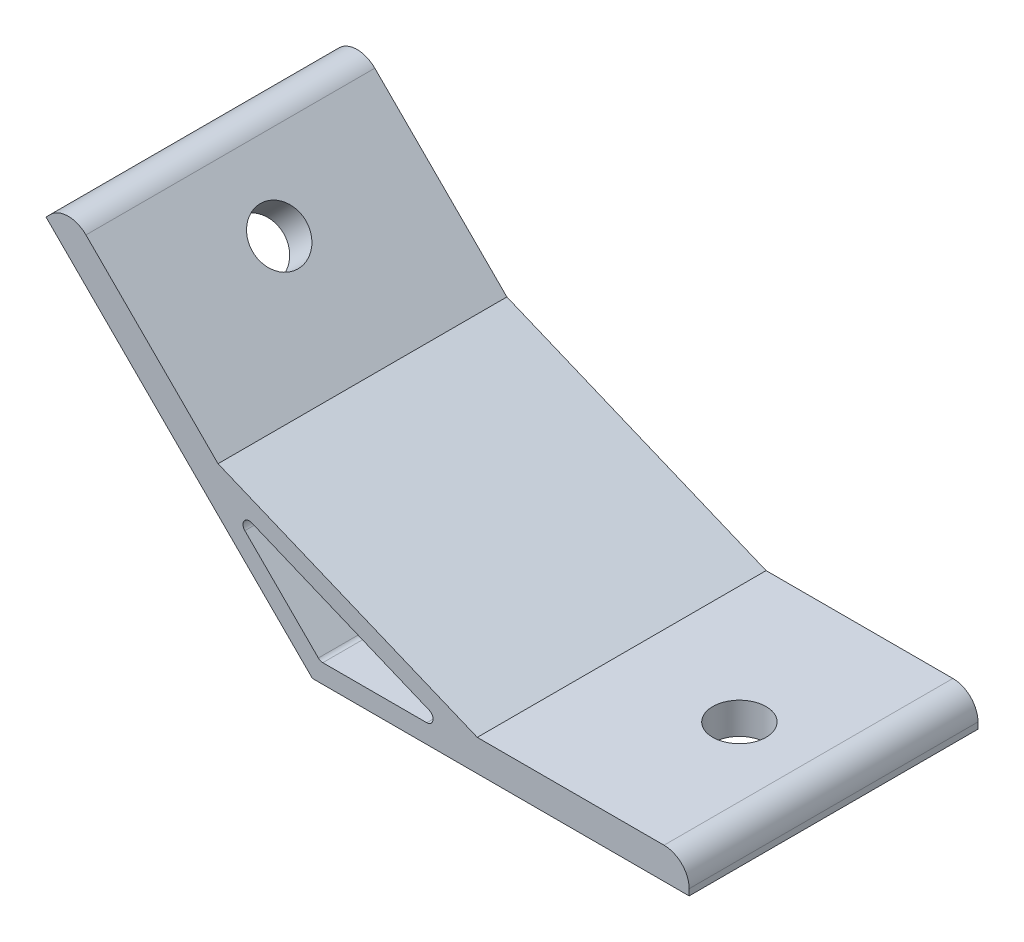
ISO-10303-21;
HEADER;
FILE_DESCRIPTION(('STEP AP214'),'2;1');
FILE_NAME('part.step','',(''),(''),'','','');
FILE_SCHEMA(('AUTOMOTIVE_DESIGN { 1 0 10303 214 1 1 1 1 }'));
ENDSEC;
DATA;
#1=APPLICATION_CONTEXT('core data for automotive mechanical design processes');
#2=APPLICATION_PROTOCOL_DEFINITION('international standard','automotive_design',2000,#1);
#3=PRODUCT_CONTEXT('',#1,'mechanical');
#4=PRODUCT('Part','Part','',(#3));
#5=PRODUCT_RELATED_PRODUCT_CATEGORY('part','',(#4));
#6=PRODUCT_DEFINITION_FORMATION('','',#4);
#7=PRODUCT_DEFINITION_CONTEXT('part definition',#1,'design');
#8=PRODUCT_DEFINITION('design','',#6,#7);
#9=PRODUCT_DEFINITION_SHAPE('','',#8);
#10=(LENGTH_UNIT() NAMED_UNIT(*) SI_UNIT(.MILLI.,.METRE.));
#11=(NAMED_UNIT(*) PLANE_ANGLE_UNIT() SI_UNIT($,.RADIAN.));
#12=(NAMED_UNIT(*) SI_UNIT($,.STERADIAN.) SOLID_ANGLE_UNIT());
#13=UNCERTAINTY_MEASURE_WITH_UNIT(LENGTH_MEASURE(1.E-05),#10,'distance_accuracy_value','');
#14=(GEOMETRIC_REPRESENTATION_CONTEXT(3) GLOBAL_UNCERTAINTY_ASSIGNED_CONTEXT((#13)) GLOBAL_UNIT_ASSIGNED_CONTEXT((#10,
#11,#12)) REPRESENTATION_CONTEXT('',''));
#15=CARTESIAN_POINT('',(0.,0.,0.));
#16=DIRECTION('',(0.,0.,1.));
#17=DIRECTION('',(1.,0.,0.));
#18=AXIS2_PLACEMENT_3D('',#15,#16,#17);
#19=CARTESIAN_POINT('',(0.,0.,23.));
#20=DIRECTION('',(0.,0.,1.));
#21=DIRECTION('',(1.,0.,0.));
#22=AXIS2_PLACEMENT_3D('',#19,#20,#21);
#23=PLANE('',#22);
#24=DIRECTION('',(0.,1.,0.));
#25=VECTOR('',#24,1.);
#26=CARTESIAN_POINT('',(60.,5.,23.));
#27=LINE('',#26,#25);
#28=CARTESIAN_POINT('',(60.,0.,23.));
#29=VERTEX_POINT('',#28);
#30=CARTESIAN_POINT('',(60.,1.,23.));
#31=VERTEX_POINT('',#30);
#32=EDGE_CURVE('E142',#29,#31,#27,.T.);
#33=ORIENTED_EDGE('',*,*,#32,.T.);
#34=CARTESIAN_POINT('',(56.,1.,23.));
#35=DIRECTION('',(0.,0.,1.));
#36=DIRECTION('',(1.,0.,0.));
#37=AXIS2_PLACEMENT_3D('',#34,#35,#36);
#38=CIRCLE('',#37,4.);
#39=CARTESIAN_POINT('',(56.,5.,23.));
#40=VERTEX_POINT('',#39);
#41=EDGE_CURVE('E184',#31,#40,#38,.T.);
#42=ORIENTED_EDGE('',*,*,#41,.T.);
#43=DIRECTION('',(-1.,0.,0.));
#44=VECTOR('',#43,1.);
#45=CARTESIAN_POINT('',(26.2535913516314,5.,23.));
#46=LINE('',#45,#44);
#47=CARTESIAN_POINT('',(26.2535913516314,5.,23.));
#48=VERTEX_POINT('',#47);
#49=EDGE_CURVE('E153',#40,#48,#46,.T.);
#50=ORIENTED_EDGE('',*,*,#49,.T.);
#51=DIRECTION('',(-0.923879532511286,0.382683432365091,0.));
#52=VECTOR('',#51,1.);
#53=CARTESIAN_POINT('',(-15.0285585693062,22.0996263811718,23.));
#54=LINE('',#53,#52);
#55=CARTESIAN_POINT('',(-15.0285585693062,22.0996263811718,23.));
#56=VERTEX_POINT('',#55);
#57=EDGE_CURVE('E244',#48,#56,#54,.T.);
#58=ORIENTED_EDGE('',*,*,#57,.T.);
#59=DIRECTION('',(-0.707106781186546,0.707106781186549,0.));
#60=VECTOR('',#59,1.);
#61=CARTESIAN_POINT('',(-38.89087296526,45.9619407771256,23.));
#62=LINE('',#61,#60);
#63=CARTESIAN_POINT('',(-36.0624458405138,43.1335136523795,23.));
#64=VERTEX_POINT('',#63);
#65=EDGE_CURVE('E246',#56,#64,#62,.T.);
#66=ORIENTED_EDGE('',*,*,#65,.T.);
#67=CARTESIAN_POINT('',(-38.89087296526,40.3050865276333,23.));
#68=DIRECTION('',(0.,0.,1.));
#69=DIRECTION('',(1.,0.,0.));
#70=AXIS2_PLACEMENT_3D('',#67,#68,#69);
#71=CIRCLE('',#70,4.);
#72=CARTESIAN_POINT('',(-41.7193000900062,43.1335136523795,23.));
#73=VERTEX_POINT('',#72);
#74=EDGE_CURVE('E182',#64,#73,#71,.T.);
#75=ORIENTED_EDGE('',*,*,#74,.T.);
#76=DIRECTION('',(-0.707106781186549,-0.707106781186546,0.));
#77=VECTOR('',#76,1.);
#78=CARTESIAN_POINT('',(-42.4264068711928,42.4264068711929,23.));
#79=LINE('',#78,#77);
#80=CARTESIAN_POINT('',(-42.4264068711928,42.4264068711929,23.));
#81=VERTEX_POINT('',#80);
#82=EDGE_CURVE('E249',#73,#81,#79,.T.);
#83=ORIENTED_EDGE('',*,*,#82,.T.);
#84=DIRECTION('',(0.707106781186546,-0.707106781186549,0.));
#85=VECTOR('',#84,1.);
#86=CARTESIAN_POINT('',(0.,0.,23.));
#87=LINE('',#86,#85);
#88=CARTESIAN_POINT('',(0.,0.,23.));
#89=VERTEX_POINT('',#88);
#90=EDGE_CURVE('E158',#81,#89,#87,.T.);
#91=ORIENTED_EDGE('',*,*,#90,.T.);
#92=DIRECTION('',(1.,0.,0.));
#93=VECTOR('',#92,1.);
#94=CARTESIAN_POINT('',(60.,0.,23.));
#95=LINE('',#94,#93);
#96=EDGE_CURVE('E154',#89,#29,#95,.T.);
#97=ORIENTED_EDGE('',*,*,#96,.T.);
#98=EDGE_LOOP('',(#33,#42,#50,#58,#66,#75,#83,#91,#97));
#99=FACE_BOUND('',#98,.T.);
#100=DIRECTION('',(1.,0.,0.));
#101=VECTOR('',#100,1.);
#102=CARTESIAN_POINT('',(23.2426406871193,3.,23.));
#103=LINE('',#102,#101);
#104=CARTESIAN_POINT('',(1.65685424949238,3.,23.));
#105=VERTEX_POINT('',#104);
#106=CARTESIAN_POINT('',(18.2153011949935,3.,23.));
#107=VERTEX_POINT('',#106);
#108=EDGE_CURVE('E229',#105,#107,#103,.T.);
#109=ORIENTED_EDGE('',*,*,#108,.F.);
#110=CARTESIAN_POINT('',(1.65685424949239,4.,23.));
#111=DIRECTION('',(0.,0.,1.));
#112=DIRECTION('',(1.,0.,0.));
#113=AXIS2_PLACEMENT_3D('',#110,#111,#112);
#114=CIRCLE('',#113,1.);
#115=CARTESIAN_POINT('',(0.949747468305837,3.29289321881345,23.));
#116=VERTEX_POINT('',#115);
#117=EDGE_CURVE('E211',#105,#116,#114,.F.);
#118=ORIENTED_EDGE('',*,*,#117,.T.);
#119=DIRECTION('',(0.707106781186546,-0.707106781186549,0.));
#120=VECTOR('',#119,1.);
#121=CARTESIAN_POINT('',(1.24264068711929,3.,23.));
#122=LINE('',#121,#120);
#123=CARTESIAN_POINT('',(-10.7588426527756,15.001483339895,23.));
#124=VERTEX_POINT('',#123);
#125=EDGE_CURVE('E226',#124,#116,#122,.T.);
#126=ORIENTED_EDGE('',*,*,#125,.F.);
#127=CARTESIAN_POINT('',(-10.0517358715891,15.7085901210815,23.));
#128=DIRECTION('',(0.,0.,1.));
#129=DIRECTION('',(1.,0.,0.));
#130=AXIS2_PLACEMENT_3D('',#127,#128,#129);
#131=CIRCLE('',#130,1.);
#132=CARTESIAN_POINT('',(-9.66905243922398,16.6324696535928,23.));
#133=VERTEX_POINT('',#132);
#134=EDGE_CURVE('E207',#124,#133,#131,.F.);
#135=ORIENTED_EDGE('',*,*,#134,.T.);
#136=DIRECTION('',(-0.923879532511286,0.382683432365091,0.));
#137=VECTOR('',#136,1.);
#138=CARTESIAN_POINT('',(-14.3137084989847,18.5563491861041,23.));
#139=LINE('',#138,#137);
#140=CARTESIAN_POINT('',(18.5979846273585,4.92387953251129,23.));
#141=VERTEX_POINT('',#140);
#142=EDGE_CURVE('E231',#141,#133,#139,.T.);
#143=ORIENTED_EDGE('',*,*,#142,.F.);
#144=CARTESIAN_POINT('',(18.2153011949935,4.,23.));
#145=DIRECTION('',(0.,0.,1.));
#146=DIRECTION('',(1.,0.,0.));
#147=AXIS2_PLACEMENT_3D('',#144,#145,#146);
#148=CIRCLE('',#147,1.);
#149=EDGE_CURVE('E11',#141,#107,#148,.F.);
#150=ORIENTED_EDGE('',*,*,#149,.T.);
#151=EDGE_LOOP('',(#109,#118,#126,#135,#143,#150));
#152=FACE_BOUND('',#151,.T.);
#153=ADVANCED_FACE('F35',(#99,#152),#23,.T.);
#154=CARTESIAN_POINT('',(0.,0.,-23.));
#155=DIRECTION('',(0.,0.,1.));
#156=DIRECTION('',(1.,0.,0.));
#157=AXIS2_PLACEMENT_3D('',#154,#155,#156);
#158=PLANE('',#157);
#159=DIRECTION('',(-1.,0.,0.));
#160=VECTOR('',#159,1.);
#161=CARTESIAN_POINT('',(26.2535913516314,5.,-23.));
#162=LINE('',#161,#160);
#163=CARTESIAN_POINT('',(56.,5.,-23.));
#164=VERTEX_POINT('',#163);
#165=CARTESIAN_POINT('',(26.2535913516314,5.,-23.));
#166=VERTEX_POINT('',#165);
#167=EDGE_CURVE('E256',#164,#166,#162,.T.);
#168=ORIENTED_EDGE('',*,*,#167,.F.);
#169=CARTESIAN_POINT('',(56.,1.,-23.));
#170=DIRECTION('',(0.,0.,1.));
#171=DIRECTION('',(1.,0.,0.));
#172=AXIS2_PLACEMENT_3D('',#169,#170,#171);
#173=CIRCLE('',#172,4.);
#174=CARTESIAN_POINT('',(60.,1.,-23.));
#175=VERTEX_POINT('',#174);
#176=EDGE_CURVE('E179',#164,#175,#173,.F.);
#177=ORIENTED_EDGE('',*,*,#176,.T.);
#178=DIRECTION('',(0.,1.,0.));
#179=VECTOR('',#178,1.);
#180=CARTESIAN_POINT('',(60.,5.,-23.));
#181=LINE('',#180,#179);
#182=CARTESIAN_POINT('',(60.,0.,-23.));
#183=VERTEX_POINT('',#182);
#184=EDGE_CURVE('E254',#183,#175,#181,.T.);
#185=ORIENTED_EDGE('',*,*,#184,.F.);
#186=DIRECTION('',(1.,0.,0.));
#187=VECTOR('',#186,1.);
#188=CARTESIAN_POINT('',(60.,0.,-23.));
#189=LINE('',#188,#187);
#190=CARTESIAN_POINT('',(0.,0.,-23.));
#191=VERTEX_POINT('',#190);
#192=EDGE_CURVE('E166',#191,#183,#189,.T.);
#193=ORIENTED_EDGE('',*,*,#192,.F.);
#194=DIRECTION('',(0.707106781186546,-0.707106781186549,0.));
#195=VECTOR('',#194,1.);
#196=CARTESIAN_POINT('',(0.,0.,-23.));
#197=LINE('',#196,#195);
#198=CARTESIAN_POINT('',(-42.4264068711928,42.4264068711929,-23.));
#199=VERTEX_POINT('',#198);
#200=EDGE_CURVE('E162',#199,#191,#197,.T.);
#201=ORIENTED_EDGE('',*,*,#200,.F.);
#202=DIRECTION('',(-0.707106781186549,-0.707106781186546,0.));
#203=VECTOR('',#202,1.);
#204=CARTESIAN_POINT('',(-42.4264068711928,42.4264068711929,-23.));
#205=LINE('',#204,#203);
#206=CARTESIAN_POINT('',(-41.7193000900062,43.1335136523795,-23.));
#207=VERTEX_POINT('',#206);
#208=EDGE_CURVE('E263',#207,#199,#205,.T.);
#209=ORIENTED_EDGE('',*,*,#208,.F.);
#210=CARTESIAN_POINT('',(-38.89087296526,40.3050865276333,-23.));
#211=DIRECTION('',(0.,0.,1.));
#212=DIRECTION('',(1.,0.,0.));
#213=AXIS2_PLACEMENT_3D('',#210,#211,#212);
#214=CIRCLE('',#213,4.);
#215=CARTESIAN_POINT('',(-36.0624458405138,43.1335136523795,-23.));
#216=VERTEX_POINT('',#215);
#217=EDGE_CURVE('E171',#207,#216,#214,.F.);
#218=ORIENTED_EDGE('',*,*,#217,.T.);
#219=DIRECTION('',(-0.707106781186546,0.707106781186549,0.));
#220=VECTOR('',#219,1.);
#221=CARTESIAN_POINT('',(-38.89087296526,45.9619407771256,-23.));
#222=LINE('',#221,#220);
#223=CARTESIAN_POINT('',(-15.0285585693062,22.0996263811718,-23.));
#224=VERTEX_POINT('',#223);
#225=EDGE_CURVE('E260',#224,#216,#222,.T.);
#226=ORIENTED_EDGE('',*,*,#225,.F.);
#227=DIRECTION('',(-0.923879532511286,0.382683432365091,0.));
#228=VECTOR('',#227,1.);
#229=CARTESIAN_POINT('',(-15.0285585693062,22.0996263811718,-23.));
#230=LINE('',#229,#228);
#231=EDGE_CURVE('E258',#166,#224,#230,.T.);
#232=ORIENTED_EDGE('',*,*,#231,.F.);
#233=EDGE_LOOP('',(#168,#177,#185,#193,#201,#209,#218,#226,#232));
#234=FACE_BOUND('',#233,.T.);
#235=DIRECTION('',(-0.923879532511286,0.382683432365091,0.));
#236=VECTOR('',#235,1.);
#237=CARTESIAN_POINT('',(-14.3137084989847,18.5563491861041,-23.));
#238=LINE('',#237,#236);
#239=CARTESIAN_POINT('',(18.5979846273585,4.92387953251129,-23.));
#240=VERTEX_POINT('',#239);
#241=CARTESIAN_POINT('',(-9.66905243922398,16.6324696535928,-23.));
#242=VERTEX_POINT('',#241);
#243=EDGE_CURVE('E217',#240,#242,#238,.T.);
#244=ORIENTED_EDGE('',*,*,#243,.T.);
#245=CARTESIAN_POINT('',(-10.0517358715891,15.7085901210815,-23.));
#246=DIRECTION('',(0.,0.,1.));
#247=DIRECTION('',(1.,0.,0.));
#248=AXIS2_PLACEMENT_3D('',#245,#246,#247);
#249=CIRCLE('',#248,1.);
#250=CARTESIAN_POINT('',(-10.7588426527756,15.001483339895,-23.));
#251=VERTEX_POINT('',#250);
#252=EDGE_CURVE('E205',#242,#251,#249,.T.);
#253=ORIENTED_EDGE('',*,*,#252,.T.);
#254=DIRECTION('',(0.707106781186546,-0.707106781186549,0.));
#255=VECTOR('',#254,1.);
#256=CARTESIAN_POINT('',(1.24264068711929,3.,-23.));
#257=LINE('',#256,#255);
#258=CARTESIAN_POINT('',(0.949747468305837,3.29289321881345,-23.));
#259=VERTEX_POINT('',#258);
#260=EDGE_CURVE('E238',#251,#259,#257,.T.);
#261=ORIENTED_EDGE('',*,*,#260,.T.);
#262=CARTESIAN_POINT('',(1.65685424949239,4.,-23.));
#263=DIRECTION('',(0.,0.,1.));
#264=DIRECTION('',(1.,0.,0.));
#265=AXIS2_PLACEMENT_3D('',#262,#263,#264);
#266=CIRCLE('',#265,1.);
#267=CARTESIAN_POINT('',(1.65685424949238,3.,-23.));
#268=VERTEX_POINT('',#267);
#269=EDGE_CURVE('E209',#259,#268,#266,.T.);
#270=ORIENTED_EDGE('',*,*,#269,.T.);
#271=DIRECTION('',(1.,0.,0.));
#272=VECTOR('',#271,1.);
#273=CARTESIAN_POINT('',(23.2426406871193,3.,-23.));
#274=LINE('',#273,#272);
#275=CARTESIAN_POINT('',(18.2153011949935,3.,-23.));
#276=VERTEX_POINT('',#275);
#277=EDGE_CURVE('E218',#268,#276,#274,.T.);
#278=ORIENTED_EDGE('',*,*,#277,.T.);
#279=CARTESIAN_POINT('',(18.2153011949935,4.,-23.));
#280=DIRECTION('',(0.,0.,1.));
#281=DIRECTION('',(1.,0.,0.));
#282=AXIS2_PLACEMENT_3D('',#279,#280,#281);
#283=CIRCLE('',#282,1.);
#284=EDGE_CURVE('E43',#276,#240,#283,.T.);
#285=ORIENTED_EDGE('',*,*,#284,.T.);
#286=EDGE_LOOP('',(#244,#253,#261,#270,#278,#285));
#287=FACE_BOUND('',#286,.T.);
#288=ADVANCED_FACE('F216',(#234,#287),#158,.F.);
#289=CARTESIAN_POINT('',(60.,0.,23.));
#290=DIRECTION('',(0.,1.,0.));
#291=DIRECTION('',(0.,0.,1.));
#292=AXIS2_PLACEMENT_3D('',#289,#290,#291);
#293=PLANE('',#292);
#294=CARTESIAN_POINT('',(45.,0.,0.));
#295=DIRECTION('',(0.,-1.,0.));
#296=DIRECTION('',(0.,0.,-1.));
#297=AXIS2_PLACEMENT_3D('',#294,#295,#296);
#298=CIRCLE('',#297,4.25000000000001);
#299=CARTESIAN_POINT('',(45.,0.,-4.25000000000001));
#300=VERTEX_POINT('',#299);
#301=EDGE_CURVE('E343',#300,#300,#298,.T.);
#302=ORIENTED_EDGE('',*,*,#301,.F.);
#303=EDGE_LOOP('',(#302));
#304=FACE_BOUND('',#303,.T.);
#305=ORIENTED_EDGE('',*,*,#192,.T.);
#306=DIRECTION('',(0.,0.,-1.));
#307=VECTOR('',#306,1.);
#308=CARTESIAN_POINT('',(60.,0.,23.));
#309=LINE('',#308,#307);
#310=EDGE_CURVE('E147',#29,#183,#309,.T.);
#311=ORIENTED_EDGE('',*,*,#310,.F.);
#312=ORIENTED_EDGE('',*,*,#96,.F.);
#313=DIRECTION('',(0.,0.,-1.));
#314=VECTOR('',#313,1.);
#315=CARTESIAN_POINT('',(0.,0.,23.));
#316=LINE('',#315,#314);
#317=EDGE_CURVE('E252',#89,#191,#316,.T.);
#318=ORIENTED_EDGE('',*,*,#317,.T.);
#319=EDGE_LOOP('',(#305,#311,#312,#318));
#320=FACE_BOUND('',#319,.T.);
#321=ADVANCED_FACE('F164',(#304,#320),#293,.F.);
#322=CARTESIAN_POINT('',(60.,5.,23.));
#323=DIRECTION('',(-1.,0.,0.));
#324=DIRECTION('',(0.,0.,1.));
#325=AXIS2_PLACEMENT_3D('',#322,#323,#324);
#326=PLANE('',#325);
#327=ORIENTED_EDGE('',*,*,#184,.T.);
#328=DIRECTION('',(0.,0.,-1.));
#329=VECTOR('',#328,1.);
#330=CARTESIAN_POINT('',(60.,1.,23.));
#331=LINE('',#330,#329);
#332=EDGE_CURVE('E150',#175,#31,#331,.F.);
#333=ORIENTED_EDGE('',*,*,#332,.T.);
#334=ORIENTED_EDGE('',*,*,#32,.F.);
#335=ORIENTED_EDGE('',*,*,#310,.T.);
#336=EDGE_LOOP('',(#327,#333,#334,#335));
#337=FACE_BOUND('',#336,.T.);
#338=ADVANCED_FACE('F145',(#337),#326,.F.);
#339=CARTESIAN_POINT('',(26.2535913516314,5.,23.));
#340=DIRECTION('',(0.,-1.,0.));
#341=DIRECTION('',(0.,0.,-1.));
#342=AXIS2_PLACEMENT_3D('',#339,#340,#341);
#343=PLANE('',#342);
#344=CARTESIAN_POINT('',(45.,5.,0.));
#345=DIRECTION('',(0.,-1.,0.));
#346=DIRECTION('',(0.,0.,-1.));
#347=AXIS2_PLACEMENT_3D('',#344,#345,#346);
#348=CIRCLE('',#347,4.25000000000001);
#349=CARTESIAN_POINT('',(45.,5.,-4.25000000000001));
#350=VERTEX_POINT('',#349);
#351=EDGE_CURVE('E345',#350,#350,#348,.F.);
#352=ORIENTED_EDGE('',*,*,#351,.F.);
#353=EDGE_LOOP('',(#352));
#354=FACE_BOUND('',#353,.T.);
#355=ORIENTED_EDGE('',*,*,#49,.F.);
#356=DIRECTION('',(0.,0.,-1.));
#357=VECTOR('',#356,1.);
#358=CARTESIAN_POINT('',(56.,5.,23.));
#359=LINE('',#358,#357);
#360=EDGE_CURVE('E167',#40,#164,#359,.T.);
#361=ORIENTED_EDGE('',*,*,#360,.T.);
#362=ORIENTED_EDGE('',*,*,#167,.T.);
#363=DIRECTION('',(0.,0.,-1.));
#364=VECTOR('',#363,1.);
#365=CARTESIAN_POINT('',(26.2535913516314,5.,23.));
#366=LINE('',#365,#364);
#367=EDGE_CURVE('E168',#48,#166,#366,.T.);
#368=ORIENTED_EDGE('',*,*,#367,.F.);
#369=EDGE_LOOP('',(#355,#361,#362,#368));
#370=FACE_BOUND('',#369,.T.);
#371=ADVANCED_FACE('F295',(#354,#370),#343,.F.);
#372=CARTESIAN_POINT('',(-15.0285585693062,22.0996263811718,23.));
#373=DIRECTION('',(-0.382683432365091,-0.923879532511287,0.));
#374=DIRECTION('',(0.923879532511287,-0.382683432365091,0.));
#375=AXIS2_PLACEMENT_3D('',#372,#373,#374);
#376=PLANE('',#375);
#377=ORIENTED_EDGE('',*,*,#231,.T.);
#378=DIRECTION('',(0.,0.,-1.));
#379=VECTOR('',#378,1.);
#380=CARTESIAN_POINT('',(-15.0285585693062,22.0996263811718,23.));
#381=LINE('',#380,#379);
#382=EDGE_CURVE('E174',#56,#224,#381,.T.);
#383=ORIENTED_EDGE('',*,*,#382,.F.);
#384=ORIENTED_EDGE('',*,*,#57,.F.);
#385=ORIENTED_EDGE('',*,*,#367,.T.);
#386=EDGE_LOOP('',(#377,#383,#384,#385));
#387=FACE_BOUND('',#386,.T.);
#388=ADVANCED_FACE('F293',(#387),#376,.F.);
#389=CARTESIAN_POINT('',(-38.89087296526,45.9619407771256,23.));
#390=DIRECTION('',(-0.707106781186549,-0.707106781186546,0.));
#391=DIRECTION('',(0.707106781186546,-0.707106781186549,0.));
#392=AXIS2_PLACEMENT_3D('',#389,#390,#391);
#393=PLANE('',#392);
#394=CARTESIAN_POINT('',(-28.2842712474618,35.3553390593274,0.));
#395=DIRECTION('',(-0.707106781186549,-0.707106781186546,0.));
#396=DIRECTION('',(0.707106781186546,-0.707106781186549,0.));
#397=AXIS2_PLACEMENT_3D('',#394,#395,#396);
#398=CIRCLE('',#397,4.25);
#399=CARTESIAN_POINT('',(-25.279067427419,32.3501352392846,0.));
#400=VERTEX_POINT('',#399);
#401=EDGE_CURVE('E241',#400,#400,#398,.F.);
#402=ORIENTED_EDGE('',*,*,#401,.F.);
#403=EDGE_LOOP('',(#402));
#404=FACE_BOUND('',#403,.T.);
#405=ORIENTED_EDGE('',*,*,#225,.T.);
#406=DIRECTION('',(0.,0.,-1.));
#407=VECTOR('',#406,1.);
#408=CARTESIAN_POINT('',(-36.0624458405138,43.1335136523795,23.));
#409=LINE('',#408,#407);
#410=EDGE_CURVE('E189',#216,#64,#409,.F.);
#411=ORIENTED_EDGE('',*,*,#410,.T.);
#412=ORIENTED_EDGE('',*,*,#65,.F.);
#413=ORIENTED_EDGE('',*,*,#382,.T.);
#414=EDGE_LOOP('',(#405,#411,#412,#413));
#415=FACE_BOUND('',#414,.T.);
#416=ADVANCED_FACE('F274',(#404,#415),#393,.F.);
#417=CARTESIAN_POINT('',(-42.4264068711928,42.4264068711929,23.));
#418=DIRECTION('',(0.707106781186546,-0.707106781186549,0.));
#419=DIRECTION('',(0.707106781186549,0.707106781186546,0.));
#420=AXIS2_PLACEMENT_3D('',#417,#418,#419);
#421=PLANE('',#420);
#422=ORIENTED_EDGE('',*,*,#82,.F.);
#423=DIRECTION('',(0.,0.,-1.));
#424=VECTOR('',#423,1.);
#425=CARTESIAN_POINT('',(-41.7193000900062,43.1335136523795,23.));
#426=LINE('',#425,#424);
#427=EDGE_CURVE('E186',#73,#207,#426,.T.);
#428=ORIENTED_EDGE('',*,*,#427,.T.);
#429=ORIENTED_EDGE('',*,*,#208,.T.);
#430=DIRECTION('',(0.,0.,-1.));
#431=VECTOR('',#430,1.);
#432=CARTESIAN_POINT('',(-42.4264068711928,42.4264068711929,23.));
#433=LINE('',#432,#431);
#434=EDGE_CURVE('E267',#81,#199,#433,.T.);
#435=ORIENTED_EDGE('',*,*,#434,.F.);
#436=EDGE_LOOP('',(#422,#428,#429,#435));
#437=FACE_BOUND('',#436,.T.);
#438=ADVANCED_FACE('F289',(#437),#421,.F.);
#439=CARTESIAN_POINT('',(0.,0.,23.));
#440=DIRECTION('',(0.707106781186549,0.707106781186546,0.));
#441=DIRECTION('',(-0.707106781186546,0.707106781186549,0.));
#442=AXIS2_PLACEMENT_3D('',#439,#440,#441);
#443=PLANE('',#442);
#444=CARTESIAN_POINT('',(-31.8198051533946,31.8198051533947,0.));
#445=DIRECTION('',(-0.707106781186549,-0.707106781186546,0.));
#446=DIRECTION('',(0.707106781186546,-0.707106781186549,0.));
#447=AXIS2_PLACEMENT_3D('',#444,#445,#446);
#448=CIRCLE('',#447,4.25);
#449=CARTESIAN_POINT('',(-28.8146013333518,28.8146013333519,0.));
#450=VERTEX_POINT('',#449);
#451=EDGE_CURVE('E348',#450,#450,#448,.T.);
#452=ORIENTED_EDGE('',*,*,#451,.F.);
#453=EDGE_LOOP('',(#452));
#454=FACE_BOUND('',#453,.T.);
#455=ORIENTED_EDGE('',*,*,#200,.T.);
#456=ORIENTED_EDGE('',*,*,#317,.F.);
#457=ORIENTED_EDGE('',*,*,#90,.F.);
#458=ORIENTED_EDGE('',*,*,#434,.T.);
#459=EDGE_LOOP('',(#455,#456,#457,#458));
#460=FACE_BOUND('',#459,.T.);
#461=ADVANCED_FACE('F322',(#454,#460),#443,.F.);
#462=CARTESIAN_POINT('',(1.24264068711929,3.,23.));
#463=DIRECTION('',(0.707106781186549,0.707106781186546,0.));
#464=DIRECTION('',(-0.707106781186546,0.707106781186549,0.));
#465=AXIS2_PLACEMENT_3D('',#462,#463,#464);
#466=PLANE('',#465);
#467=ORIENTED_EDGE('',*,*,#260,.F.);
#468=DIRECTION('',(0.,0.,-1.));
#469=VECTOR('',#468,1.);
#470=CARTESIAN_POINT('',(-10.7588426527756,15.001483339895,23.));
#471=LINE('',#470,#469);
#472=EDGE_CURVE('E199',#251,#124,#471,.F.);
#473=ORIENTED_EDGE('',*,*,#472,.T.);
#474=ORIENTED_EDGE('',*,*,#125,.T.);
#475=DIRECTION('',(0.,0.,-1.));
#476=VECTOR('',#475,1.);
#477=CARTESIAN_POINT('',(0.949747468305837,3.29289321881345,-23.));
#478=LINE('',#477,#476);
#479=EDGE_CURVE('E196',#116,#259,#478,.T.);
#480=ORIENTED_EDGE('',*,*,#479,.T.);
#481=EDGE_LOOP('',(#467,#473,#474,#480));
#482=FACE_BOUND('',#481,.T.);
#483=ADVANCED_FACE('F319',(#482),#466,.T.);
#484=CARTESIAN_POINT('',(23.2426406871193,3.,23.));
#485=DIRECTION('',(0.,1.,0.));
#486=DIRECTION('',(0.,0.,1.));
#487=AXIS2_PLACEMENT_3D('',#484,#485,#486);
#488=PLANE('',#487);
#489=ORIENTED_EDGE('',*,*,#277,.F.);
#490=DIRECTION('',(0.,0.,-1.));
#491=VECTOR('',#490,1.);
#492=CARTESIAN_POINT('',(1.65685424949239,3.,23.));
#493=LINE('',#492,#491);
#494=EDGE_CURVE('E55',#268,#105,#493,.F.);
#495=ORIENTED_EDGE('',*,*,#494,.T.);
#496=ORIENTED_EDGE('',*,*,#108,.T.);
#497=DIRECTION('',(0.,0.,-1.));
#498=VECTOR('',#497,1.);
#499=CARTESIAN_POINT('',(18.2153011949935,3.,-23.));
#500=LINE('',#499,#498);
#501=EDGE_CURVE('E201',#107,#276,#500,.T.);
#502=ORIENTED_EDGE('',*,*,#501,.T.);
#503=EDGE_LOOP('',(#489,#495,#496,#502));
#504=FACE_BOUND('',#503,.T.);
#505=ADVANCED_FACE('F228',(#504),#488,.T.);
#506=CARTESIAN_POINT('',(-14.3137084989847,18.5563491861041,23.));
#507=DIRECTION('',(-0.382683432365091,-0.923879532511286,0.));
#508=DIRECTION('',(0.923879532511287,-0.382683432365091,0.));
#509=AXIS2_PLACEMENT_3D('',#506,#507,#508);
#510=PLANE('',#509);
#511=ORIENTED_EDGE('',*,*,#142,.T.);
#512=DIRECTION('',(0.,0.,-1.));
#513=VECTOR('',#512,1.);
#514=CARTESIAN_POINT('',(-9.66905243922398,16.6324696535928,-23.));
#515=LINE('',#514,#513);
#516=EDGE_CURVE('E193',#133,#242,#515,.T.);
#517=ORIENTED_EDGE('',*,*,#516,.T.);
#518=ORIENTED_EDGE('',*,*,#243,.F.);
#519=DIRECTION('',(0.,0.,-1.));
#520=VECTOR('',#519,1.);
#521=CARTESIAN_POINT('',(18.5979846273585,4.92387953251129,23.));
#522=LINE('',#521,#520);
#523=EDGE_CURVE('E191',#240,#141,#522,.F.);
#524=ORIENTED_EDGE('',*,*,#523,.T.);
#525=EDGE_LOOP('',(#511,#517,#518,#524));
#526=FACE_BOUND('',#525,.T.);
#527=ADVANCED_FACE('F224',(#526),#510,.T.);
#528=CARTESIAN_POINT('',(-19.7842712474618,43.8553390593274,0.));
#529=DIRECTION('',(-0.707106781186549,-0.707106781186546,0.));
#530=DIRECTION('',(0.707106781186546,-0.707106781186549,0.));
#531=AXIS2_PLACEMENT_3D('',#528,#529,#530);
#532=CYLINDRICAL_SURFACE('',#531,4.25);
#533=ORIENTED_EDGE('',*,*,#401,.T.);
#534=EDGE_LOOP('',(#533));
#535=FACE_BOUND('',#534,.T.);
#536=ORIENTED_EDGE('',*,*,#451,.T.);
#537=EDGE_LOOP('',(#536));
#538=FACE_BOUND('',#537,.T.);
#539=ADVANCED_FACE('F308',(#535,#538),#532,.F.);
#540=CARTESIAN_POINT('',(45.,17.0208152801713,0.));
#541=DIRECTION('',(0.,-1.,0.));
#542=DIRECTION('',(0.,0.,-1.));
#543=AXIS2_PLACEMENT_3D('',#540,#541,#542);
#544=CYLINDRICAL_SURFACE('',#543,4.25000000000001);
#545=ORIENTED_EDGE('',*,*,#351,.T.);
#546=EDGE_LOOP('',(#545));
#547=FACE_BOUND('',#546,.T.);
#548=ORIENTED_EDGE('',*,*,#301,.T.);
#549=EDGE_LOOP('',(#548));
#550=FACE_BOUND('',#549,.T.);
#551=ADVANCED_FACE('F300',(#547,#550),#544,.F.);
#552=CARTESIAN_POINT('',(56.,1.,23.));
#553=DIRECTION('',(0.,0.,-1.));
#554=DIRECTION('',(-1.,0.,0.));
#555=AXIS2_PLACEMENT_3D('',#552,#553,#554);
#556=CYLINDRICAL_SURFACE('',#555,4.);
#557=ORIENTED_EDGE('',*,*,#41,.F.);
#558=ORIENTED_EDGE('',*,*,#332,.F.);
#559=ORIENTED_EDGE('',*,*,#176,.F.);
#560=ORIENTED_EDGE('',*,*,#360,.F.);
#561=EDGE_LOOP('',(#557,#558,#559,#560));
#562=FACE_BOUND('',#561,.T.);
#563=ADVANCED_FACE('F298',(#562),#556,.T.);
#564=CARTESIAN_POINT('',(-38.89087296526,40.3050865276333,23.));
#565=DIRECTION('',(0.,0.,-1.));
#566=DIRECTION('',(-1.,0.,0.));
#567=AXIS2_PLACEMENT_3D('',#564,#565,#566);
#568=CYLINDRICAL_SURFACE('',#567,4.);
#569=ORIENTED_EDGE('',*,*,#74,.F.);
#570=ORIENTED_EDGE('',*,*,#410,.F.);
#571=ORIENTED_EDGE('',*,*,#217,.F.);
#572=ORIENTED_EDGE('',*,*,#427,.F.);
#573=EDGE_LOOP('',(#569,#570,#571,#572));
#574=FACE_BOUND('',#573,.T.);
#575=ADVANCED_FACE('F286',(#574),#568,.T.);
#576=CARTESIAN_POINT('',(-10.0517358715891,15.7085901210815,23.));
#577=DIRECTION('',(0.,0.,1.));
#578=DIRECTION('',(1.,0.,0.));
#579=AXIS2_PLACEMENT_3D('',#576,#577,#578);
#580=CYLINDRICAL_SURFACE('',#579,1.);
#581=ORIENTED_EDGE('',*,*,#134,.F.);
#582=ORIENTED_EDGE('',*,*,#472,.F.);
#583=ORIENTED_EDGE('',*,*,#252,.F.);
#584=ORIENTED_EDGE('',*,*,#516,.F.);
#585=EDGE_LOOP('',(#581,#582,#583,#584));
#586=FACE_BOUND('',#585,.T.);
#587=ADVANCED_FACE('F306',(#586),#580,.F.);
#588=CARTESIAN_POINT('',(1.65685424949239,4.,23.));
#589=DIRECTION('',(0.,0.,1.));
#590=DIRECTION('',(1.,0.,0.));
#591=AXIS2_PLACEMENT_3D('',#588,#589,#590);
#592=CYLINDRICAL_SURFACE('',#591,1.);
#593=ORIENTED_EDGE('',*,*,#117,.F.);
#594=ORIENTED_EDGE('',*,*,#494,.F.);
#595=ORIENTED_EDGE('',*,*,#269,.F.);
#596=ORIENTED_EDGE('',*,*,#479,.F.);
#597=EDGE_LOOP('',(#593,#594,#595,#596));
#598=FACE_BOUND('',#597,.T.);
#599=ADVANCED_FACE('F378',(#598),#592,.F.);
#600=CARTESIAN_POINT('',(18.2153011949935,4.,23.));
#601=DIRECTION('',(0.,0.,1.));
#602=DIRECTION('',(1.,0.,0.));
#603=AXIS2_PLACEMENT_3D('',#600,#601,#602);
#604=CYLINDRICAL_SURFACE('',#603,1.);
#605=ORIENTED_EDGE('',*,*,#149,.F.);
#606=ORIENTED_EDGE('',*,*,#523,.F.);
#607=ORIENTED_EDGE('',*,*,#284,.F.);
#608=ORIENTED_EDGE('',*,*,#501,.F.);
#609=EDGE_LOOP('',(#605,#606,#607,#608));
#610=FACE_BOUND('',#609,.T.);
#611=ADVANCED_FACE('F37',(#610),#604,.F.);
#612=CLOSED_SHELL('',(#153,#288,#321,#338,#371,#388,#416,#438,#461,#483,#505,#527,#539,#551,
#563,#575,#587,#599,#611));
#613=MANIFOLD_SOLID_BREP('B2',#612);
#614=ADVANCED_BREP_SHAPE_REPRESENTATION('',(#18,#613),#14);
#615=SHAPE_DEFINITION_REPRESENTATION(#9,#614);
ENDSEC;
END-ISO-10303-21;
